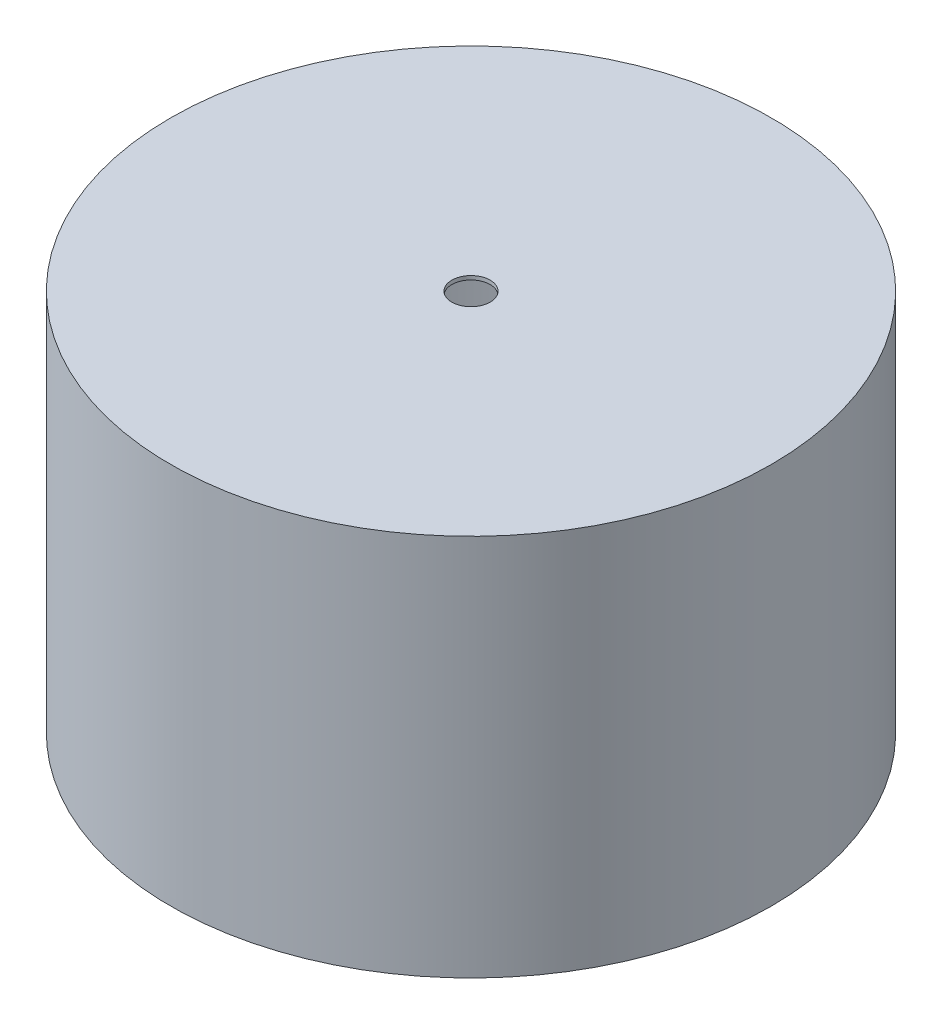
ISO-10303-21;
HEADER;
FILE_DESCRIPTION(('STEP AP214'),'2;1');
FILE_NAME('part.step','',(''),(''),'','','');
FILE_SCHEMA(('AUTOMOTIVE_DESIGN { 1 0 10303 214 1 1 1 1 }'));
ENDSEC;
DATA;
#1=APPLICATION_CONTEXT('core data for automotive mechanical design processes');
#2=APPLICATION_PROTOCOL_DEFINITION('international standard','automotive_design',2000,#1);
#3=PRODUCT_CONTEXT('',#1,'mechanical');
#4=PRODUCT('Part','Part','',(#3));
#5=PRODUCT_RELATED_PRODUCT_CATEGORY('part','',(#4));
#6=PRODUCT_DEFINITION_FORMATION('','',#4);
#7=PRODUCT_DEFINITION_CONTEXT('part definition',#1,'design');
#8=PRODUCT_DEFINITION('design','',#6,#7);
#9=PRODUCT_DEFINITION_SHAPE('','',#8);
#10=(LENGTH_UNIT() NAMED_UNIT(*) SI_UNIT(.MILLI.,.METRE.));
#11=(NAMED_UNIT(*) PLANE_ANGLE_UNIT() SI_UNIT($,.RADIAN.));
#12=(NAMED_UNIT(*) SI_UNIT($,.STERADIAN.) SOLID_ANGLE_UNIT());
#13=UNCERTAINTY_MEASURE_WITH_UNIT(LENGTH_MEASURE(1.E-05),#10,'distance_accuracy_value','');
#14=(GEOMETRIC_REPRESENTATION_CONTEXT(3) GLOBAL_UNCERTAINTY_ASSIGNED_CONTEXT((#13)) GLOBAL_UNIT_ASSIGNED_CONTEXT((#10,
#11,#12)) REPRESENTATION_CONTEXT('',''));
#15=CARTESIAN_POINT('',(0.,0.,0.));
#16=DIRECTION('',(0.,0.,1.));
#17=DIRECTION('',(1.,0.,0.));
#18=AXIS2_PLACEMENT_3D('',#15,#16,#17);
#19=CARTESIAN_POINT('',(0.,-1.,0.));
#20=DIRECTION('',(0.,1.,0.));
#21=DIRECTION('',(0.,0.,1.));
#22=AXIS2_PLACEMENT_3D('',#19,#20,#21);
#23=PLANE('',#22);
#24=CARTESIAN_POINT('',(0.,-1.,0.));
#25=DIRECTION('',(0.,1.,0.));
#26=DIRECTION('',(0.,0.,1.));
#27=AXIS2_PLACEMENT_3D('',#24,#25,#26);
#28=CIRCLE('',#27,5.);
#29=CARTESIAN_POINT('',(0.,-1.,5.));
#30=VERTEX_POINT('',#29);
#31=EDGE_CURVE('E56',#30,#30,#28,.T.);
#32=ORIENTED_EDGE('',*,*,#31,.T.);
#33=EDGE_LOOP('',(#32));
#34=FACE_BOUND('',#33,.T.);
#35=CARTESIAN_POINT('',(0.,-1.,0.));
#36=DIRECTION('',(0.,1.,0.));
#37=DIRECTION('',(0.,0.,1.));
#38=AXIS2_PLACEMENT_3D('',#35,#36,#37);
#39=CIRCLE('',#38,77.5);
#40=CARTESIAN_POINT('',(0.,-1.,77.5));
#41=VERTEX_POINT('',#40);
#42=EDGE_CURVE('E11',#41,#41,#39,.T.);
#43=ORIENTED_EDGE('',*,*,#42,.F.);
#44=EDGE_LOOP('',(#43));
#45=FACE_BOUND('',#44,.T.);
#46=ADVANCED_FACE('F36',(#34,#45),#23,.F.);
#47=CARTESIAN_POINT('',(0.,-100.,0.));
#48=DIRECTION('',(0.,1.,0.));
#49=DIRECTION('',(0.,0.,1.));
#50=AXIS2_PLACEMENT_3D('',#47,#48,#49);
#51=CYLINDRICAL_SURFACE('',#50,77.5);
#52=CARTESIAN_POINT('',(0.,-100.,0.));
#53=DIRECTION('',(0.,1.,0.));
#54=DIRECTION('',(0.,0.,1.));
#55=AXIS2_PLACEMENT_3D('',#52,#53,#54);
#56=CIRCLE('',#55,77.5);
#57=CARTESIAN_POINT('',(0.,-100.,77.5));
#58=VERTEX_POINT('',#57);
#59=EDGE_CURVE('E52',#58,#58,#56,.T.);
#60=ORIENTED_EDGE('',*,*,#59,.F.);
#61=EDGE_LOOP('',(#60));
#62=FACE_BOUND('',#61,.T.);
#63=ORIENTED_EDGE('',*,*,#42,.T.);
#64=EDGE_LOOP('',(#63));
#65=FACE_BOUND('',#64,.T.);
#66=ADVANCED_FACE('F73',(#62,#65),#51,.F.);
#67=CARTESIAN_POINT('',(0.,-100.,0.));
#68=DIRECTION('',(0.,1.,0.));
#69=DIRECTION('',(0.,0.,1.));
#70=AXIS2_PLACEMENT_3D('',#67,#68,#69);
#71=CYLINDRICAL_SURFACE('',#70,78.5);
#72=CARTESIAN_POINT('',(0.,-100.,0.));
#73=DIRECTION('',(0.,1.,0.));
#74=DIRECTION('',(1.,0.,0.));
#75=AXIS2_PLACEMENT_3D('',#72,#73,#74);
#76=CIRCLE('',#75,78.5);
#77=CARTESIAN_POINT('',(78.5,-100.,0.));
#78=VERTEX_POINT('',#77);
#79=EDGE_CURVE('E43',#78,#78,#76,.T.);
#80=ORIENTED_EDGE('',*,*,#79,.T.);
#81=EDGE_LOOP('',(#80));
#82=FACE_BOUND('',#81,.T.);
#83=CARTESIAN_POINT('',(0.,0.,0.));
#84=DIRECTION('',(0.,1.,0.));
#85=DIRECTION('',(1.,0.,0.));
#86=AXIS2_PLACEMENT_3D('',#83,#84,#85);
#87=CIRCLE('',#86,78.5);
#88=CARTESIAN_POINT('',(78.5,0.,0.));
#89=VERTEX_POINT('',#88);
#90=EDGE_CURVE('E47',#89,#89,#87,.T.);
#91=ORIENTED_EDGE('',*,*,#90,.F.);
#92=EDGE_LOOP('',(#91));
#93=FACE_BOUND('',#92,.T.);
#94=ADVANCED_FACE('F71',(#82,#93),#71,.T.);
#95=CARTESIAN_POINT('',(0.,-100.,0.));
#96=DIRECTION('',(0.,1.,0.));
#97=DIRECTION('',(0.,0.,1.));
#98=AXIS2_PLACEMENT_3D('',#95,#96,#97);
#99=PLANE('',#98);
#100=ORIENTED_EDGE('',*,*,#59,.T.);
#101=EDGE_LOOP('',(#100));
#102=FACE_BOUND('',#101,.T.);
#103=ORIENTED_EDGE('',*,*,#79,.F.);
#104=EDGE_LOOP('',(#103));
#105=FACE_BOUND('',#104,.T.);
#106=ADVANCED_FACE('F68',(#102,#105),#99,.F.);
#107=CARTESIAN_POINT('',(0.,0.,0.));
#108=DIRECTION('',(0.,1.,0.));
#109=DIRECTION('',(0.,0.,1.));
#110=AXIS2_PLACEMENT_3D('',#107,#108,#109);
#111=PLANE('',#110);
#112=CARTESIAN_POINT('',(0.,0.,0.));
#113=DIRECTION('',(0.,1.,0.));
#114=DIRECTION('',(0.,0.,1.));
#115=AXIS2_PLACEMENT_3D('',#112,#113,#114);
#116=CIRCLE('',#115,5.);
#117=CARTESIAN_POINT('',(0.,0.,5.));
#118=VERTEX_POINT('',#117);
#119=EDGE_CURVE('E59',#118,#118,#116,.T.);
#120=ORIENTED_EDGE('',*,*,#119,.F.);
#121=EDGE_LOOP('',(#120));
#122=FACE_BOUND('',#121,.T.);
#123=ORIENTED_EDGE('',*,*,#90,.T.);
#124=EDGE_LOOP('',(#123));
#125=FACE_BOUND('',#124,.T.);
#126=ADVANCED_FACE('F38',(#122,#125),#111,.T.);
#127=CARTESIAN_POINT('',(0.,-100.,0.));
#128=DIRECTION('',(0.,1.,0.));
#129=DIRECTION('',(0.,0.,1.));
#130=AXIS2_PLACEMENT_3D('',#127,#128,#129);
#131=CYLINDRICAL_SURFACE('',#130,5.);
#132=ORIENTED_EDGE('',*,*,#119,.T.);
#133=EDGE_LOOP('',(#132));
#134=FACE_BOUND('',#133,.T.);
#135=ORIENTED_EDGE('',*,*,#31,.F.);
#136=EDGE_LOOP('',(#135));
#137=FACE_BOUND('',#136,.T.);
#138=ADVANCED_FACE('F63',(#134,#137),#131,.F.);
#139=CLOSED_SHELL('',(#46,#66,#94,#106,#126,#138));
#140=MANIFOLD_SOLID_BREP('B2',#139);
#141=ADVANCED_BREP_SHAPE_REPRESENTATION('',(#18,#140),#14);
#142=SHAPE_DEFINITION_REPRESENTATION(#9,#141);
ENDSEC;
END-ISO-10303-21;
